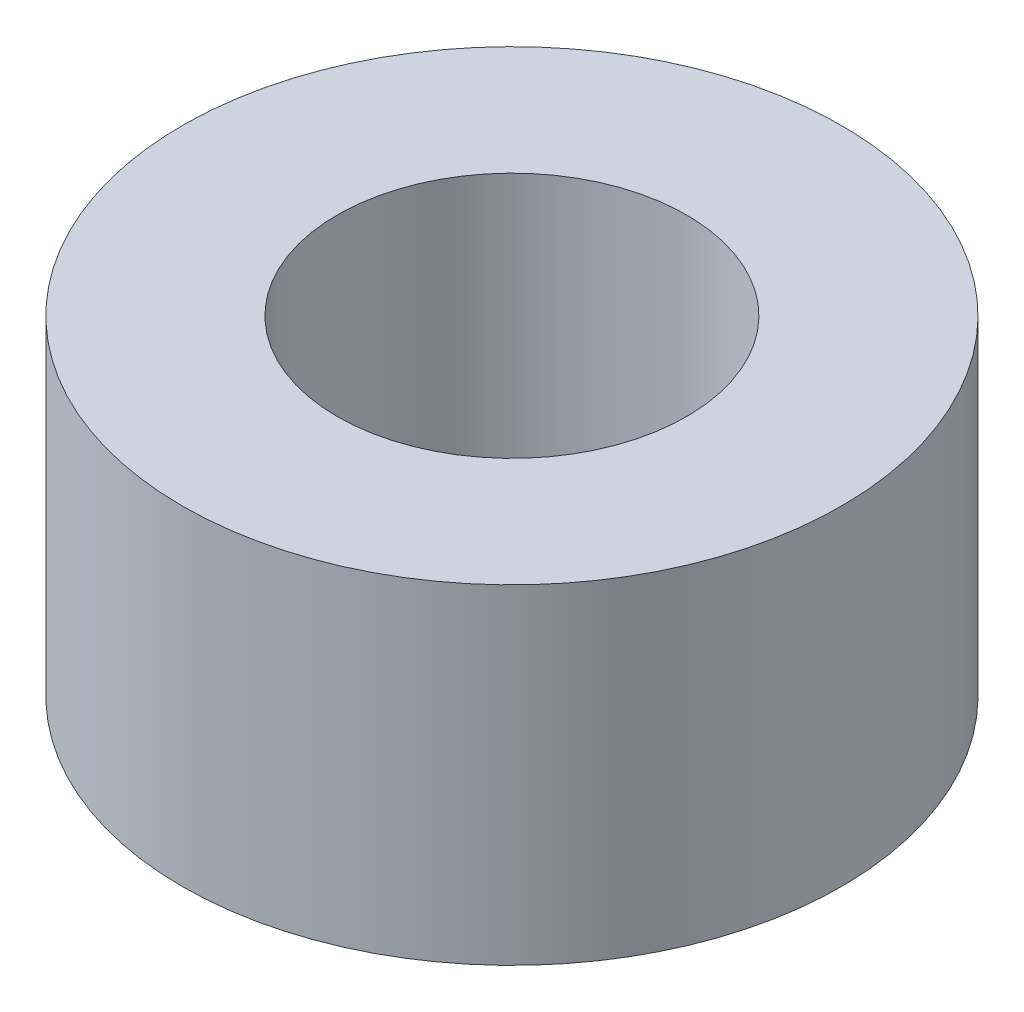
ISO-10303-21;
HEADER;
FILE_DESCRIPTION(('STEP AP214'),'2;1');
FILE_NAME('part.step','',(''),(''),'','','');
FILE_SCHEMA(('AUTOMOTIVE_DESIGN { 1 0 10303 214 1 1 1 1 }'));
ENDSEC;
DATA;
#1=APPLICATION_CONTEXT('core data for automotive mechanical design processes');
#2=APPLICATION_PROTOCOL_DEFINITION('international standard','automotive_design',2000,#1);
#3=PRODUCT_CONTEXT('',#1,'mechanical');
#4=PRODUCT('Part','Part','',(#3));
#5=PRODUCT_RELATED_PRODUCT_CATEGORY('part','',(#4));
#6=PRODUCT_DEFINITION_FORMATION('','',#4);
#7=PRODUCT_DEFINITION_CONTEXT('part definition',#1,'design');
#8=PRODUCT_DEFINITION('design','',#6,#7);
#9=PRODUCT_DEFINITION_SHAPE('','',#8);
#10=(LENGTH_UNIT() NAMED_UNIT(*) SI_UNIT(.MILLI.,.METRE.));
#11=(NAMED_UNIT(*) PLANE_ANGLE_UNIT() SI_UNIT($,.RADIAN.));
#12=(NAMED_UNIT(*) SI_UNIT($,.STERADIAN.) SOLID_ANGLE_UNIT());
#13=UNCERTAINTY_MEASURE_WITH_UNIT(LENGTH_MEASURE(1.E-05),#10,'distance_accuracy_value','');
#14=(GEOMETRIC_REPRESENTATION_CONTEXT(3) GLOBAL_UNCERTAINTY_ASSIGNED_CONTEXT((#13)) GLOBAL_UNIT_ASSIGNED_CONTEXT((#10,
#11,#12)) REPRESENTATION_CONTEXT('',''));
#15=CARTESIAN_POINT('',(0.,0.,0.));
#16=DIRECTION('',(0.,0.,1.));
#17=DIRECTION('',(1.,0.,0.));
#18=AXIS2_PLACEMENT_3D('',#15,#16,#17);
#19=CARTESIAN_POINT('',(0.,5.,0.));
#20=DIRECTION('',(0.,1.,0.));
#21=DIRECTION('',(0.,0.,1.));
#22=AXIS2_PLACEMENT_3D('',#19,#20,#21);
#23=PLANE('',#22);
#24=CARTESIAN_POINT('',(0.,5.,0.));
#25=DIRECTION('',(0.,1.,0.));
#26=DIRECTION('',(0.,0.,1.));
#27=AXIS2_PLACEMENT_3D('',#24,#25,#26);
#28=CIRCLE('',#27,5.);
#29=CARTESIAN_POINT('',(0.,5.,5.));
#30=VERTEX_POINT('',#29);
#31=EDGE_CURVE('E10',#30,#30,#28,.T.);
#32=ORIENTED_EDGE('',*,*,#31,.T.);
#33=EDGE_LOOP('',(#32));
#34=FACE_BOUND('',#33,.T.);
#35=CARTESIAN_POINT('',(0.,5.,0.));
#36=DIRECTION('',(0.,1.,0.));
#37=DIRECTION('',(0.,0.,1.));
#38=AXIS2_PLACEMENT_3D('',#35,#36,#37);
#39=CIRCLE('',#38,2.65);
#40=CARTESIAN_POINT('',(0.,5.,2.65));
#41=VERTEX_POINT('',#40);
#42=EDGE_CURVE('E41',#41,#41,#39,.T.);
#43=ORIENTED_EDGE('',*,*,#42,.F.);
#44=EDGE_LOOP('',(#43));
#45=FACE_BOUND('',#44,.T.);
#46=ADVANCED_FACE('F30',(#34,#45),#23,.T.);
#47=CARTESIAN_POINT('',(0.,0.,0.));
#48=DIRECTION('',(0.,1.,0.));
#49=DIRECTION('',(0.,0.,1.));
#50=AXIS2_PLACEMENT_3D('',#47,#48,#49);
#51=PLANE('',#50);
#52=CARTESIAN_POINT('',(0.,0.,0.));
#53=DIRECTION('',(0.,1.,0.));
#54=DIRECTION('',(0.,0.,1.));
#55=AXIS2_PLACEMENT_3D('',#52,#53,#54);
#56=CIRCLE('',#55,5.);
#57=CARTESIAN_POINT('',(0.,0.,5.));
#58=VERTEX_POINT('',#57);
#59=EDGE_CURVE('E34',#58,#58,#56,.T.);
#60=ORIENTED_EDGE('',*,*,#59,.F.);
#61=EDGE_LOOP('',(#60));
#62=FACE_BOUND('',#61,.T.);
#63=CARTESIAN_POINT('',(0.,0.,0.));
#64=DIRECTION('',(0.,1.,0.));
#65=DIRECTION('',(0.,0.,1.));
#66=AXIS2_PLACEMENT_3D('',#63,#64,#65);
#67=CIRCLE('',#66,2.65);
#68=CARTESIAN_POINT('',(0.,0.,2.65));
#69=VERTEX_POINT('',#68);
#70=EDGE_CURVE('E43',#69,#69,#67,.T.);
#71=ORIENTED_EDGE('',*,*,#70,.T.);
#72=EDGE_LOOP('',(#71));
#73=FACE_BOUND('',#72,.T.);
#74=ADVANCED_FACE('F53',(#62,#73),#51,.F.);
#75=CARTESIAN_POINT('',(0.,5.,0.));
#76=DIRECTION('',(0.,-1.,0.));
#77=DIRECTION('',(0.,0.,-1.));
#78=AXIS2_PLACEMENT_3D('',#75,#76,#77);
#79=CYLINDRICAL_SURFACE('',#78,5.);
#80=ORIENTED_EDGE('',*,*,#31,.F.);
#81=EDGE_LOOP('',(#80));
#82=FACE_BOUND('',#81,.T.);
#83=ORIENTED_EDGE('',*,*,#59,.T.);
#84=EDGE_LOOP('',(#83));
#85=FACE_BOUND('',#84,.T.);
#86=ADVANCED_FACE('F32',(#82,#85),#79,.T.);
#87=CARTESIAN_POINT('',(0.,5.,0.));
#88=DIRECTION('',(0.,-1.,0.));
#89=DIRECTION('',(0.,0.,-1.));
#90=AXIS2_PLACEMENT_3D('',#87,#88,#89);
#91=CYLINDRICAL_SURFACE('',#90,2.65);
#92=ORIENTED_EDGE('',*,*,#42,.T.);
#93=EDGE_LOOP('',(#92));
#94=FACE_BOUND('',#93,.T.);
#95=ORIENTED_EDGE('',*,*,#70,.F.);
#96=EDGE_LOOP('',(#95));
#97=FACE_BOUND('',#96,.T.);
#98=ADVANCED_FACE('F49',(#94,#97),#91,.F.);
#99=CLOSED_SHELL('',(#46,#74,#86,#98));
#100=MANIFOLD_SOLID_BREP('B2',#99);
#101=ADVANCED_BREP_SHAPE_REPRESENTATION('',(#18,#100),#14);
#102=SHAPE_DEFINITION_REPRESENTATION(#9,#101);
ENDSEC;
END-ISO-10303-21;
